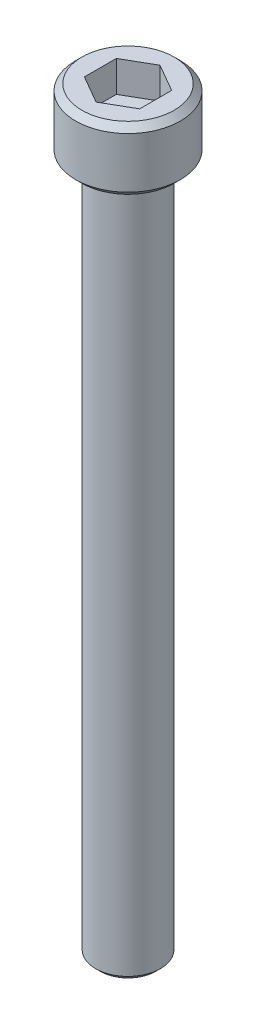
ISO-10303-21;
HEADER;
FILE_DESCRIPTION(('STEP AP214'),'2;1');
FILE_NAME('part.step','',(''),(''),'','','');
FILE_SCHEMA(('AUTOMOTIVE_DESIGN { 1 0 10303 214 1 1 1 1 }'));
ENDSEC;
DATA;
#1=APPLICATION_CONTEXT('core data for automotive mechanical design processes');
#2=APPLICATION_PROTOCOL_DEFINITION('international standard','automotive_design',2000,#1);
#3=PRODUCT_CONTEXT('',#1,'mechanical');
#4=PRODUCT('Part','Part','',(#3));
#5=PRODUCT_RELATED_PRODUCT_CATEGORY('part','',(#4));
#6=PRODUCT_DEFINITION_FORMATION('','',#4);
#7=PRODUCT_DEFINITION_CONTEXT('part definition',#1,'design');
#8=PRODUCT_DEFINITION('design','',#6,#7);
#9=PRODUCT_DEFINITION_SHAPE('','',#8);
#10=(LENGTH_UNIT() NAMED_UNIT(*) SI_UNIT(.MILLI.,.METRE.));
#11=(NAMED_UNIT(*) PLANE_ANGLE_UNIT() SI_UNIT($,.RADIAN.));
#12=(NAMED_UNIT(*) SI_UNIT($,.STERADIAN.) SOLID_ANGLE_UNIT());
#13=UNCERTAINTY_MEASURE_WITH_UNIT(LENGTH_MEASURE(1.E-05),#10,'distance_accuracy_value','');
#14=(GEOMETRIC_REPRESENTATION_CONTEXT(3) GLOBAL_UNCERTAINTY_ASSIGNED_CONTEXT((#13)) GLOBAL_UNIT_ASSIGNED_CONTEXT((#10,
#11,#12)) REPRESENTATION_CONTEXT('',''));
#15=CARTESIAN_POINT('',(0.,0.,0.));
#16=DIRECTION('',(0.,0.,1.));
#17=DIRECTION('',(1.,0.,0.));
#18=AXIS2_PLACEMENT_3D('',#15,#16,#17);
#19=CARTESIAN_POINT('',(1.778,2.064,3.07958633585746));
#20=DIRECTION('',(0.,1.,0.));
#21=DIRECTION('',(0.,0.,1.));
#22=AXIS2_PLACEMENT_3D('',#19,#20,#21);
#23=PLANE('',#22);
#24=DIRECTION('',(-0.866025403784439,0.,0.5));
#25=VECTOR('',#24,1.);
#26=CARTESIAN_POINT('',(0.,2.064,-2.05305755723831));
#27=LINE('',#26,#25);
#28=CARTESIAN_POINT('',(0.,2.064,-2.05305755723831));
#29=VERTEX_POINT('',#28);
#30=CARTESIAN_POINT('',(-1.778,2.064,-1.02652877861915));
#31=VERTEX_POINT('',#30);
#32=EDGE_CURVE('E67',#29,#31,#27,.T.);
#33=ORIENTED_EDGE('',*,*,#32,.T.);
#34=DIRECTION('',(0.,0.,1.));
#35=VECTOR('',#34,1.);
#36=CARTESIAN_POINT('',(-1.778,2.064,-1.02652877861915));
#37=LINE('',#36,#35);
#38=CARTESIAN_POINT('',(-1.778,2.064,1.02652877861916));
#39=VERTEX_POINT('',#38);
#40=EDGE_CURVE('E69',#31,#39,#37,.T.);
#41=ORIENTED_EDGE('',*,*,#40,.T.);
#42=DIRECTION('',(0.866025403784439,0.,0.499999999999999));
#43=VECTOR('',#42,1.);
#44=CARTESIAN_POINT('',(-1.778,2.064,1.02652877861916));
#45=LINE('',#44,#43);
#46=CARTESIAN_POINT('',(0.,2.064,2.05305755723831));
#47=VERTEX_POINT('',#46);
#48=EDGE_CURVE('E71',#39,#47,#45,.T.);
#49=ORIENTED_EDGE('',*,*,#48,.T.);
#50=DIRECTION('',(0.866025403784438,0.,-0.500000000000001));
#51=VECTOR('',#50,1.);
#52=CARTESIAN_POINT('',(0.,2.064,2.05305755723831));
#53=LINE('',#52,#51);
#54=CARTESIAN_POINT('',(1.778,2.064,1.02652877861915));
#55=VERTEX_POINT('',#54);
#56=EDGE_CURVE('E126',#47,#55,#53,.T.);
#57=ORIENTED_EDGE('',*,*,#56,.T.);
#58=DIRECTION('',(0.,0.,-1.));
#59=VECTOR('',#58,1.);
#60=CARTESIAN_POINT('',(1.778,2.064,1.02652877861915));
#61=LINE('',#60,#59);
#62=CARTESIAN_POINT('',(1.778,2.064,-1.02652877861916));
#63=VERTEX_POINT('',#62);
#64=EDGE_CURVE('E131',#55,#63,#61,.T.);
#65=ORIENTED_EDGE('',*,*,#64,.T.);
#66=DIRECTION('',(-0.866025403784439,0.,-0.499999999999999));
#67=VECTOR('',#66,1.);
#68=CARTESIAN_POINT('',(1.778,2.064,-1.02652877861916));
#69=LINE('',#68,#67);
#70=EDGE_CURVE('E135',#63,#29,#69,.T.);
#71=ORIENTED_EDGE('',*,*,#70,.T.);
#72=EDGE_LOOP('',(#33,#41,#49,#57,#65,#71));
#73=FACE_BOUND('',#72,.T.);
#74=ADVANCED_FACE('F16',(#73),#23,.T.);
#75=CARTESIAN_POINT('',(-1.778,2.064,1.02652877861916));
#76=DIRECTION('',(-0.499999999999999,0.,0.866025403784439));
#77=DIRECTION('',(0.866025403784439,0.,0.499999999999999));
#78=AXIS2_PLACEMENT_3D('',#75,#76,#77);
#79=PLANE('',#78);
#80=DIRECTION('',(0.,1.,0.));
#81=VECTOR('',#80,1.);
#82=CARTESIAN_POINT('',(0.,2.064,2.05305755723831));
#83=LINE('',#82,#81);
#84=CARTESIAN_POINT('',(0.,4.064,2.05305755723831));
#85=VERTEX_POINT('',#84);
#86=EDGE_CURVE('E82',#85,#47,#83,.F.);
#87=ORIENTED_EDGE('',*,*,#86,.T.);
#88=ORIENTED_EDGE('',*,*,#48,.F.);
#89=DIRECTION('',(0.,1.,0.));
#90=VECTOR('',#89,1.);
#91=CARTESIAN_POINT('',(-1.778,2.064,1.02652877861916));
#92=LINE('',#91,#90);
#93=CARTESIAN_POINT('',(-1.778,4.064,1.02652877861916));
#94=VERTEX_POINT('',#93);
#95=EDGE_CURVE('E76',#39,#94,#92,.T.);
#96=ORIENTED_EDGE('',*,*,#95,.T.);
#97=DIRECTION('',(-0.866025403784439,0.,-0.5));
#98=VECTOR('',#97,1.);
#99=CARTESIAN_POINT('',(0.,4.064,2.05305755723831));
#100=LINE('',#99,#98);
#101=EDGE_CURVE('E123',#85,#94,#100,.T.);
#102=ORIENTED_EDGE('',*,*,#101,.F.);
#103=EDGE_LOOP('',(#87,#88,#96,#102));
#104=FACE_BOUND('',#103,.T.);
#105=ADVANCED_FACE('F79',(#104),#79,.F.);
#106=CARTESIAN_POINT('',(-1.778,2.064,-1.02652877861915));
#107=DIRECTION('',(-1.,0.,0.));
#108=DIRECTION('',(0.,0.,1.));
#109=AXIS2_PLACEMENT_3D('',#106,#107,#108);
#110=PLANE('',#109);
#111=ORIENTED_EDGE('',*,*,#95,.F.);
#112=ORIENTED_EDGE('',*,*,#40,.F.);
#113=DIRECTION('',(0.,1.,0.));
#114=VECTOR('',#113,1.);
#115=CARTESIAN_POINT('',(-1.778,2.064,-1.02652877861915));
#116=LINE('',#115,#114);
#117=CARTESIAN_POINT('',(-1.778,4.064,-1.02652877861915));
#118=VERTEX_POINT('',#117);
#119=EDGE_CURVE('E90',#31,#118,#116,.T.);
#120=ORIENTED_EDGE('',*,*,#119,.T.);
#121=DIRECTION('',(0.,0.,1.));
#122=VECTOR('',#121,1.);
#123=CARTESIAN_POINT('',(-1.778,4.064,0.));
#124=LINE('',#123,#122);
#125=EDGE_CURVE('E87',#94,#118,#124,.F.);
#126=ORIENTED_EDGE('',*,*,#125,.F.);
#127=EDGE_LOOP('',(#111,#112,#120,#126));
#128=FACE_BOUND('',#127,.T.);
#129=ADVANCED_FACE('F85',(#128),#110,.F.);
#130=CARTESIAN_POINT('',(0.,2.064,-2.05305755723831));
#131=DIRECTION('',(-0.5,0.,-0.866025403784439));
#132=DIRECTION('',(-0.866025403784439,0.,0.5));
#133=AXIS2_PLACEMENT_3D('',#130,#131,#132);
#134=PLANE('',#133);
#135=ORIENTED_EDGE('',*,*,#119,.F.);
#136=ORIENTED_EDGE('',*,*,#32,.F.);
#137=DIRECTION('',(0.,1.,0.));
#138=VECTOR('',#137,1.);
#139=CARTESIAN_POINT('',(0.,2.064,-2.05305755723831));
#140=LINE('',#139,#138);
#141=CARTESIAN_POINT('',(0.,4.064,-2.05305755723831));
#142=VERTEX_POINT('',#141);
#143=EDGE_CURVE('E133',#29,#142,#140,.T.);
#144=ORIENTED_EDGE('',*,*,#143,.T.);
#145=DIRECTION('',(0.866025403784438,0.,-0.5));
#146=VECTOR('',#145,1.);
#147=CARTESIAN_POINT('',(-1.778,4.064,-1.02652877861915));
#148=LINE('',#147,#146);
#149=EDGE_CURVE('E119',#118,#142,#148,.T.);
#150=ORIENTED_EDGE('',*,*,#149,.F.);
#151=EDGE_LOOP('',(#135,#136,#144,#150));
#152=FACE_BOUND('',#151,.T.);
#153=ADVANCED_FACE('F138',(#152),#134,.F.);
#154=CARTESIAN_POINT('',(1.778,2.064,-1.02652877861916));
#155=DIRECTION('',(0.499999999999999,0.,-0.866025403784439));
#156=DIRECTION('',(-0.866025403784439,0.,-0.499999999999999));
#157=AXIS2_PLACEMENT_3D('',#154,#155,#156);
#158=PLANE('',#157);
#159=ORIENTED_EDGE('',*,*,#143,.F.);
#160=ORIENTED_EDGE('',*,*,#70,.F.);
#161=DIRECTION('',(0.,1.,0.));
#162=VECTOR('',#161,1.);
#163=CARTESIAN_POINT('',(1.778,2.064,-1.02652877861916));
#164=LINE('',#163,#162);
#165=CARTESIAN_POINT('',(1.778,4.064,-1.02652877861916));
#166=VERTEX_POINT('',#165);
#167=EDGE_CURVE('E129',#63,#166,#164,.T.);
#168=ORIENTED_EDGE('',*,*,#167,.T.);
#169=DIRECTION('',(0.866025403784439,0.,0.5));
#170=VECTOR('',#169,1.);
#171=CARTESIAN_POINT('',(0.,4.064,-2.05305755723831));
#172=LINE('',#171,#170);
#173=EDGE_CURVE('E116',#142,#166,#172,.T.);
#174=ORIENTED_EDGE('',*,*,#173,.F.);
#175=EDGE_LOOP('',(#159,#160,#168,#174));
#176=FACE_BOUND('',#175,.T.);
#177=ADVANCED_FACE('F150',(#176),#158,.F.);
#178=CARTESIAN_POINT('',(1.778,2.064,1.02652877861915));
#179=DIRECTION('',(1.,0.,0.));
#180=DIRECTION('',(0.,0.,-1.));
#181=AXIS2_PLACEMENT_3D('',#178,#179,#180);
#182=PLANE('',#181);
#183=ORIENTED_EDGE('',*,*,#167,.F.);
#184=ORIENTED_EDGE('',*,*,#64,.F.);
#185=DIRECTION('',(0.,1.,0.));
#186=VECTOR('',#185,1.);
#187=CARTESIAN_POINT('',(1.778,2.064,1.02652877861915));
#188=LINE('',#187,#186);
#189=CARTESIAN_POINT('',(1.778,4.064,1.02652877861915));
#190=VERTEX_POINT('',#189);
#191=EDGE_CURVE('E34',#55,#190,#188,.T.);
#192=ORIENTED_EDGE('',*,*,#191,.T.);
#193=DIRECTION('',(0.,0.,1.));
#194=VECTOR('',#193,1.);
#195=CARTESIAN_POINT('',(1.778,4.064,0.));
#196=LINE('',#195,#194);
#197=EDGE_CURVE('E113',#166,#190,#196,.T.);
#198=ORIENTED_EDGE('',*,*,#197,.F.);
#199=EDGE_LOOP('',(#183,#184,#192,#198));
#200=FACE_BOUND('',#199,.T.);
#201=ADVANCED_FACE('F148',(#200),#182,.F.);
#202=CARTESIAN_POINT('',(0.,2.064,2.05305755723831));
#203=DIRECTION('',(0.500000000000001,0.,0.866025403784438));
#204=DIRECTION('',(0.866025403784438,0.,-0.500000000000001));
#205=AXIS2_PLACEMENT_3D('',#202,#203,#204);
#206=PLANE('',#205);
#207=ORIENTED_EDGE('',*,*,#191,.F.);
#208=ORIENTED_EDGE('',*,*,#56,.F.);
#209=ORIENTED_EDGE('',*,*,#86,.F.);
#210=DIRECTION('',(-0.866025403784438,0.,0.500000000000001));
#211=VECTOR('',#210,1.);
#212=CARTESIAN_POINT('',(1.778,4.064,1.02652877861915));
#213=LINE('',#212,#211);
#214=EDGE_CURVE('E110',#190,#85,#213,.T.);
#215=ORIENTED_EDGE('',*,*,#214,.F.);
#216=EDGE_LOOP('',(#207,#208,#209,#215));
#217=FACE_BOUND('',#216,.T.);
#218=ADVANCED_FACE('F145',(#217),#206,.F.);
#219=CARTESIAN_POINT('',(0.,4.064,0.));
#220=DIRECTION('',(0.,1.,0.));
#221=DIRECTION('',(0.,0.,1.));
#222=AXIS2_PLACEMENT_3D('',#219,#220,#221);
#223=PLANE('',#222);
#224=ORIENTED_EDGE('',*,*,#197,.T.);
#225=ORIENTED_EDGE('',*,*,#214,.T.);
#226=ORIENTED_EDGE('',*,*,#101,.T.);
#227=ORIENTED_EDGE('',*,*,#125,.T.);
#228=ORIENTED_EDGE('',*,*,#149,.T.);
#229=ORIENTED_EDGE('',*,*,#173,.T.);
#230=EDGE_LOOP('',(#224,#225,#226,#227,#228,#229));
#231=FACE_BOUND('',#230,.T.);
#232=CARTESIAN_POINT('',(0.,4.06400000002805,0.));
#233=DIRECTION('',(0.,-1.,0.));
#234=DIRECTION('',(0.,0.,-1.));
#235=AXIS2_PLACEMENT_3D('',#232,#233,#234);
#236=CIRCLE('',#235,2.96550000001616);
#237=CARTESIAN_POINT('',(0.,4.06400000002805,-2.96550000001616));
#238=VERTEX_POINT('',#237);
#239=EDGE_CURVE('E19',#238,#238,#236,.T.);
#240=ORIENTED_EDGE('',*,*,#239,.F.);
#241=EDGE_LOOP('',(#240));
#242=FACE_BOUND('',#241,.T.);
#243=ADVANCED_FACE('F142',(#231,#242),#223,.T.);
#244=CARTESIAN_POINT('',(0.,3.66400000001477,0.));
#245=DIRECTION('',(0.,-1.,0.));
#246=DIRECTION('',(0.,0.,-1.));
#247=AXIS2_PLACEMENT_3D('',#244,#245,#246);
#248=CONICAL_SURFACE('',#247,3.36550000002944,0.785398163397448);
#249=ORIENTED_EDGE('',*,*,#239,.T.);
#250=EDGE_LOOP('',(#249));
#251=FACE_BOUND('',#250,.T.);
#252=CARTESIAN_POINT('',(0.,3.66400000000001,0.));
#253=DIRECTION('',(0.,-1.,0.));
#254=DIRECTION('',(0.,0.,-1.));
#255=AXIS2_PLACEMENT_3D('',#252,#253,#254);
#256=CIRCLE('',#255,3.3655);
#257=CARTESIAN_POINT('',(0.,3.66400000000001,-3.3655));
#258=VERTEX_POINT('',#257);
#259=EDGE_CURVE('E102',#258,#258,#256,.T.);
#260=ORIENTED_EDGE('',*,*,#259,.F.);
#261=EDGE_LOOP('',(#260));
#262=FACE_BOUND('',#261,.T.);
#263=ADVANCED_FACE('F187',(#251,#262),#248,.T.);
#264=CARTESIAN_POINT('',(0.,4.064,0.));
#265=DIRECTION('',(0.,-1.,0.));
#266=DIRECTION('',(0.,0.,-1.));
#267=AXIS2_PLACEMENT_3D('',#264,#265,#266);
#268=CYLINDRICAL_SURFACE('',#267,3.3655);
#269=ORIENTED_EDGE('',*,*,#259,.T.);
#270=EDGE_LOOP('',(#269));
#271=FACE_BOUND('',#270,.T.);
#272=CARTESIAN_POINT('',(0.,0.400000000013279,0.));
#273=DIRECTION('',(0.,1.,0.));
#274=DIRECTION('',(0.,0.,1.));
#275=AXIS2_PLACEMENT_3D('',#272,#273,#274);
#276=CIRCLE('',#275,3.36549999991576);
#277=CARTESIAN_POINT('',(0.,0.400000000013279,3.36549999991576));
#278=VERTEX_POINT('',#277);
#279=EDGE_CURVE('E98',#278,#278,#276,.F.);
#280=ORIENTED_EDGE('',*,*,#279,.F.);
#281=EDGE_LOOP('',(#280));
#282=FACE_BOUND('',#281,.T.);
#283=ADVANCED_FACE('F183',(#271,#282),#268,.T.);
#284=CARTESIAN_POINT('',(0.,-44.45,0.));
#285=DIRECTION('',(0.,1.,0.));
#286=DIRECTION('',(0.,0.,1.));
#287=AXIS2_PLACEMENT_3D('',#284,#285,#286);
#288=PLANE('',#287);
#289=CARTESIAN_POINT('',(0.,-44.4499999999834,0.));
#290=DIRECTION('',(0.,1.,0.));
#291=DIRECTION('',(0.,0.,1.));
#292=AXIS2_PLACEMENT_3D('',#289,#290,#291);
#293=CIRCLE('',#292,1.78280000000086);
#294=CARTESIAN_POINT('',(0.,-44.4499999999834,1.78280000000086));
#295=VERTEX_POINT('',#294);
#296=EDGE_CURVE('E96',#295,#295,#293,.T.);
#297=ORIENTED_EDGE('',*,*,#296,.F.);
#298=EDGE_LOOP('',(#297));
#299=FACE_BOUND('',#298,.T.);
#300=ADVANCED_FACE('F179',(#299),#288,.F.);
#301=CARTESIAN_POINT('',(0.,0.400000000013279,0.));
#302=DIRECTION('',(0.,1.,0.));
#303=DIRECTION('',(0.,0.,1.));
#304=AXIS2_PLACEMENT_3D('',#301,#302,#303);
#305=CONICAL_SURFACE('',#304,3.36549999991576,0.785398163397448);
#306=CARTESIAN_POINT('',(0.,5.6843418860808E-11,0.));
#307=DIRECTION('',(0.,1.,0.));
#308=DIRECTION('',(0.,0.,1.));
#309=AXIS2_PLACEMENT_3D('',#306,#307,#308);
#310=CIRCLE('',#309,2.96549999995932);
#311=CARTESIAN_POINT('',(0.,5.6843418860808E-11,2.96549999995932));
#312=VERTEX_POINT('',#311);
#313=EDGE_CURVE('E94',#312,#312,#310,.T.);
#314=ORIENTED_EDGE('',*,*,#313,.T.);
#315=EDGE_LOOP('',(#314));
#316=FACE_BOUND('',#315,.T.);
#317=ORIENTED_EDGE('',*,*,#279,.T.);
#318=EDGE_LOOP('',(#317));
#319=FACE_BOUND('',#318,.T.);
#320=ADVANCED_FACE('F175',(#316,#319),#305,.T.);
#321=CARTESIAN_POINT('',(0.,-44.1500000000019,0.));
#322=DIRECTION('',(0.,1.,0.));
#323=DIRECTION('',(0.,0.,1.));
#324=AXIS2_PLACEMENT_3D('',#321,#322,#323);
#325=CONICAL_SURFACE('',#324,2.0827999999824,0.785398163397448);
#326=CARTESIAN_POINT('',(0.,-44.15,0.));
#327=DIRECTION('',(0.,1.,0.));
#328=DIRECTION('',(0.,0.,1.));
#329=AXIS2_PLACEMENT_3D('',#326,#327,#328);
#330=CIRCLE('',#329,2.0828);
#331=CARTESIAN_POINT('',(0.,-44.15,2.0828));
#332=VERTEX_POINT('',#331);
#333=EDGE_CURVE('E25',#332,#332,#330,.T.);
#334=ORIENTED_EDGE('',*,*,#333,.F.);
#335=EDGE_LOOP('',(#334));
#336=FACE_BOUND('',#335,.T.);
#337=ORIENTED_EDGE('',*,*,#296,.T.);
#338=EDGE_LOOP('',(#337));
#339=FACE_BOUND('',#338,.T.);
#340=ADVANCED_FACE('F168',(#336,#339),#325,.T.);
#341=CARTESIAN_POINT('',(0.,0.,0.));
#342=DIRECTION('',(0.,1.,0.));
#343=DIRECTION('',(0.,0.,1.));
#344=AXIS2_PLACEMENT_3D('',#341,#342,#343);
#345=PLANE('',#344);
#346=CARTESIAN_POINT('',(0.,0.,0.));
#347=DIRECTION('',(0.,1.,0.));
#348=DIRECTION('',(0.,0.,1.));
#349=AXIS2_PLACEMENT_3D('',#346,#347,#348);
#350=CIRCLE('',#349,2.0828);
#351=CARTESIAN_POINT('',(0.,0.,2.0828));
#352=VERTEX_POINT('',#351);
#353=EDGE_CURVE('E11',#352,#352,#350,.F.);
#354=ORIENTED_EDGE('',*,*,#353,.F.);
#355=EDGE_LOOP('',(#354));
#356=FACE_BOUND('',#355,.T.);
#357=ORIENTED_EDGE('',*,*,#313,.F.);
#358=EDGE_LOOP('',(#357));
#359=FACE_BOUND('',#358,.T.);
#360=ADVANCED_FACE('F162',(#356,#359),#345,.F.);
#361=CARTESIAN_POINT('',(0.,-44.45,0.));
#362=DIRECTION('',(0.,1.,0.));
#363=DIRECTION('',(0.,0.,1.));
#364=AXIS2_PLACEMENT_3D('',#361,#362,#363);
#365=CYLINDRICAL_SURFACE('',#364,2.0828);
#366=ORIENTED_EDGE('',*,*,#353,.T.);
#367=EDGE_LOOP('',(#366));
#368=FACE_BOUND('',#367,.T.);
#369=ORIENTED_EDGE('',*,*,#333,.T.);
#370=EDGE_LOOP('',(#369));
#371=FACE_BOUND('',#370,.T.);
#372=ADVANCED_FACE('F160',(#368,#371),#365,.T.);
#373=CLOSED_SHELL('',(#74,#105,#129,#153,#177,#201,#218,#243,#263,#283,#300,#320,#340,#360,#372));
#374=MANIFOLD_SOLID_BREP('B1',#373);
#375=ADVANCED_BREP_SHAPE_REPRESENTATION('',(#18,#374),#14);
#376=SHAPE_DEFINITION_REPRESENTATION(#9,#375);
ENDSEC;
END-ISO-10303-21;
